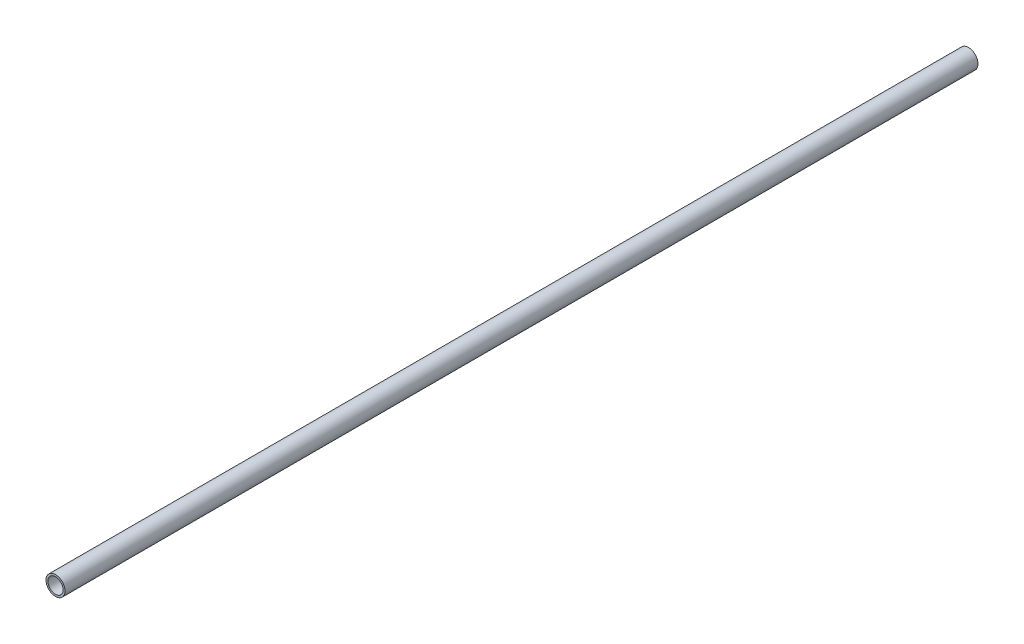
ISO-10303-21;
HEADER;
FILE_DESCRIPTION(('STEP AP214'),'2;1');
FILE_NAME('part.step','',(''),(''),'','','');
FILE_SCHEMA(('AUTOMOTIVE_DESIGN { 1 0 10303 214 1 1 1 1 }'));
ENDSEC;
DATA;
#1=APPLICATION_CONTEXT('core data for automotive mechanical design processes');
#2=APPLICATION_PROTOCOL_DEFINITION('international standard','automotive_design',2000,#1);
#3=PRODUCT_CONTEXT('',#1,'mechanical');
#4=PRODUCT('Part','Part','',(#3));
#5=PRODUCT_RELATED_PRODUCT_CATEGORY('part','',(#4));
#6=PRODUCT_DEFINITION_FORMATION('','',#4);
#7=PRODUCT_DEFINITION_CONTEXT('part definition',#1,'design');
#8=PRODUCT_DEFINITION('design','',#6,#7);
#9=PRODUCT_DEFINITION_SHAPE('','',#8);
#10=(LENGTH_UNIT() NAMED_UNIT(*) SI_UNIT(.MILLI.,.METRE.));
#11=(NAMED_UNIT(*) PLANE_ANGLE_UNIT() SI_UNIT($,.RADIAN.));
#12=(NAMED_UNIT(*) SI_UNIT($,.STERADIAN.) SOLID_ANGLE_UNIT());
#13=UNCERTAINTY_MEASURE_WITH_UNIT(LENGTH_MEASURE(1.E-05),#10,'distance_accuracy_value','');
#14=(GEOMETRIC_REPRESENTATION_CONTEXT(3) GLOBAL_UNCERTAINTY_ASSIGNED_CONTEXT((#13)) GLOBAL_UNIT_ASSIGNED_CONTEXT((#10,
#11,#12)) REPRESENTATION_CONTEXT('',''));
#15=CARTESIAN_POINT('',(0.,0.,0.));
#16=DIRECTION('',(0.,0.,1.));
#17=DIRECTION('',(1.,0.,0.));
#18=AXIS2_PLACEMENT_3D('',#15,#16,#17);
#19=CARTESIAN_POINT('',(0.,0.,1219.2));
#20=DIRECTION('',(0.,0.,1.));
#21=DIRECTION('',(1.,0.,0.));
#22=AXIS2_PLACEMENT_3D('',#19,#20,#21);
#23=PLANE('',#22);
#24=CARTESIAN_POINT('',(0.,0.,1219.2));
#25=DIRECTION('',(0.,0.,1.));
#26=DIRECTION('',(1.,0.,0.));
#27=AXIS2_PLACEMENT_3D('',#24,#25,#26);
#28=CIRCLE('',#27,12.7);
#29=CARTESIAN_POINT('',(12.7,0.,1219.2));
#30=VERTEX_POINT('',#29);
#31=EDGE_CURVE('E10',#30,#30,#28,.T.);
#32=ORIENTED_EDGE('',*,*,#31,.T.);
#33=EDGE_LOOP('',(#32));
#34=FACE_BOUND('',#33,.T.);
#35=CARTESIAN_POINT('',(0.,0.,1219.2));
#36=DIRECTION('',(0.,0.,1.));
#37=DIRECTION('',(1.,0.,0.));
#38=AXIS2_PLACEMENT_3D('',#35,#36,#37);
#39=CIRCLE('',#38,10.16);
#40=CARTESIAN_POINT('',(10.16,0.,1219.2));
#41=VERTEX_POINT('',#40);
#42=EDGE_CURVE('E41',#41,#41,#39,.T.);
#43=ORIENTED_EDGE('',*,*,#42,.F.);
#44=EDGE_LOOP('',(#43));
#45=FACE_BOUND('',#44,.T.);
#46=ADVANCED_FACE('F30',(#34,#45),#23,.T.);
#47=CARTESIAN_POINT('',(0.,0.,0.));
#48=DIRECTION('',(0.,0.,1.));
#49=DIRECTION('',(1.,0.,0.));
#50=AXIS2_PLACEMENT_3D('',#47,#48,#49);
#51=PLANE('',#50);
#52=CARTESIAN_POINT('',(0.,0.,0.));
#53=DIRECTION('',(0.,0.,1.));
#54=DIRECTION('',(1.,0.,0.));
#55=AXIS2_PLACEMENT_3D('',#52,#53,#54);
#56=CIRCLE('',#55,12.7);
#57=CARTESIAN_POINT('',(12.7,0.,0.));
#58=VERTEX_POINT('',#57);
#59=EDGE_CURVE('E34',#58,#58,#56,.T.);
#60=ORIENTED_EDGE('',*,*,#59,.F.);
#61=EDGE_LOOP('',(#60));
#62=FACE_BOUND('',#61,.T.);
#63=CARTESIAN_POINT('',(0.,0.,0.));
#64=DIRECTION('',(0.,0.,1.));
#65=DIRECTION('',(1.,0.,0.));
#66=AXIS2_PLACEMENT_3D('',#63,#64,#65);
#67=CIRCLE('',#66,10.16);
#68=CARTESIAN_POINT('',(10.16,0.,0.));
#69=VERTEX_POINT('',#68);
#70=EDGE_CURVE('E43',#69,#69,#67,.T.);
#71=ORIENTED_EDGE('',*,*,#70,.T.);
#72=EDGE_LOOP('',(#71));
#73=FACE_BOUND('',#72,.T.);
#74=ADVANCED_FACE('F53',(#62,#73),#51,.F.);
#75=CARTESIAN_POINT('',(0.,0.,1219.2));
#76=DIRECTION('',(0.,0.,-1.));
#77=DIRECTION('',(-1.,0.,0.));
#78=AXIS2_PLACEMENT_3D('',#75,#76,#77);
#79=CYLINDRICAL_SURFACE('',#78,12.7);
#80=ORIENTED_EDGE('',*,*,#31,.F.);
#81=EDGE_LOOP('',(#80));
#82=FACE_BOUND('',#81,.T.);
#83=ORIENTED_EDGE('',*,*,#59,.T.);
#84=EDGE_LOOP('',(#83));
#85=FACE_BOUND('',#84,.T.);
#86=ADVANCED_FACE('F32',(#82,#85),#79,.T.);
#87=CARTESIAN_POINT('',(0.,0.,1219.2));
#88=DIRECTION('',(0.,0.,-1.));
#89=DIRECTION('',(-1.,0.,0.));
#90=AXIS2_PLACEMENT_3D('',#87,#88,#89);
#91=CYLINDRICAL_SURFACE('',#90,10.16);
#92=ORIENTED_EDGE('',*,*,#42,.T.);
#93=EDGE_LOOP('',(#92));
#94=FACE_BOUND('',#93,.T.);
#95=ORIENTED_EDGE('',*,*,#70,.F.);
#96=EDGE_LOOP('',(#95));
#97=FACE_BOUND('',#96,.T.);
#98=ADVANCED_FACE('F49',(#94,#97),#91,.F.);
#99=CLOSED_SHELL('',(#46,#74,#86,#98));
#100=MANIFOLD_SOLID_BREP('B2',#99);
#101=ADVANCED_BREP_SHAPE_REPRESENTATION('',(#18,#100),#14);
#102=SHAPE_DEFINITION_REPRESENTATION(#9,#101);
ENDSEC;
END-ISO-10303-21;
